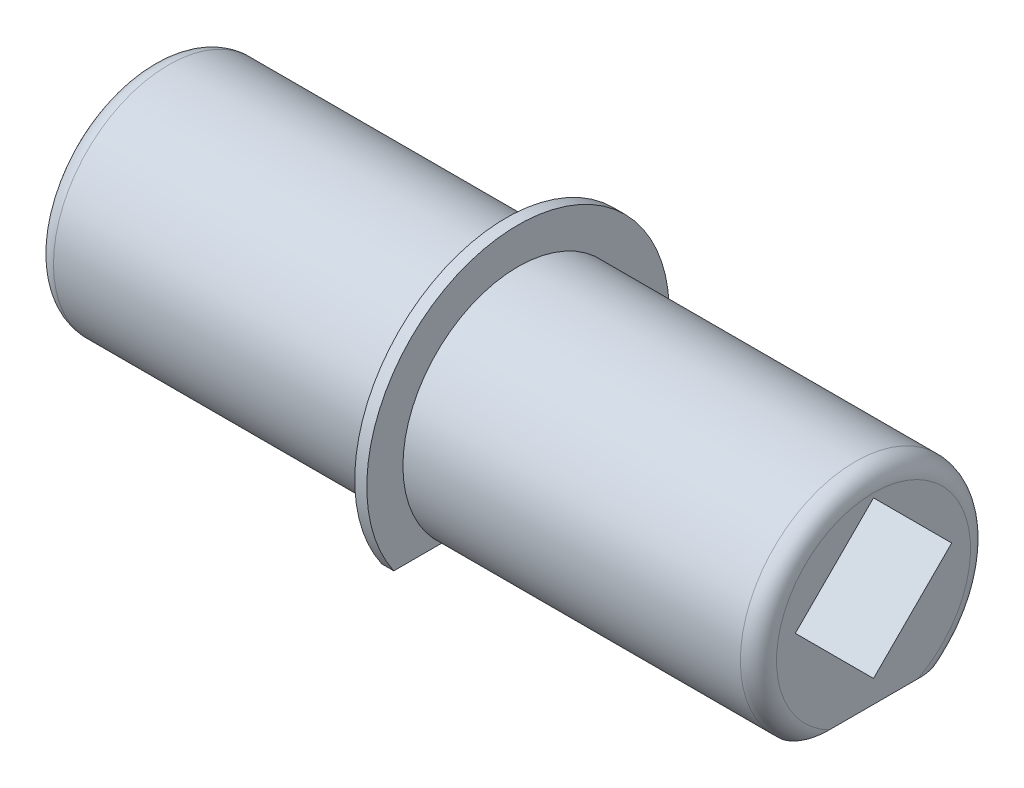
ISO-10303-21;
HEADER;
FILE_DESCRIPTION(('STEP AP214'),'2;1');
FILE_NAME('part.step','',(''),(''),'','','');
FILE_SCHEMA(('AUTOMOTIVE_DESIGN { 1 0 10303 214 1 1 1 1 }'));
ENDSEC;
DATA;
#1=APPLICATION_CONTEXT('core data for automotive mechanical design processes');
#2=APPLICATION_PROTOCOL_DEFINITION('international standard','automotive_design',2000,#1);
#3=PRODUCT_CONTEXT('',#1,'mechanical');
#4=PRODUCT('Part','Part','',(#3));
#5=PRODUCT_RELATED_PRODUCT_CATEGORY('part','',(#4));
#6=PRODUCT_DEFINITION_FORMATION('','',#4);
#7=PRODUCT_DEFINITION_CONTEXT('part definition',#1,'design');
#8=PRODUCT_DEFINITION('design','',#6,#7);
#9=PRODUCT_DEFINITION_SHAPE('','',#8);
#10=(LENGTH_UNIT() NAMED_UNIT(*) SI_UNIT(.MILLI.,.METRE.));
#11=(NAMED_UNIT(*) PLANE_ANGLE_UNIT() SI_UNIT($,.RADIAN.));
#12=(NAMED_UNIT(*) SI_UNIT($,.STERADIAN.) SOLID_ANGLE_UNIT());
#13=UNCERTAINTY_MEASURE_WITH_UNIT(LENGTH_MEASURE(1.E-05),#10,'distance_accuracy_value','');
#14=(GEOMETRIC_REPRESENTATION_CONTEXT(3) GLOBAL_UNCERTAINTY_ASSIGNED_CONTEXT((#13)) GLOBAL_UNIT_ASSIGNED_CONTEXT((#10,
#11,#12)) REPRESENTATION_CONTEXT('',''));
#15=CARTESIAN_POINT('',(0.,0.,0.));
#16=DIRECTION('',(0.,0.,1.));
#17=DIRECTION('',(1.,0.,0.));
#18=AXIS2_PLACEMENT_3D('',#15,#16,#17);
#19=CARTESIAN_POINT('',(30.,0.,0.));
#20=DIRECTION('',(-1.,0.,0.));
#21=DIRECTION('',(0.,0.,1.));
#22=AXIS2_PLACEMENT_3D('',#19,#20,#21);
#23=CYLINDRICAL_SURFACE('',#22,9.55);
#24=DIRECTION('',(-1.,0.,0.));
#25=VECTOR('',#24,1.);
#26=CARTESIAN_POINT('',(30.,-7.16095151873663,-6.31848663417939));
#27=LINE('',#26,#25);
#28=CARTESIAN_POINT('',(-0.5,-7.16095151873663,-6.31848663417939));
#29=VERTEX_POINT('',#28);
#30=CARTESIAN_POINT('',(-28.5,-7.16095151873663,-6.31848663417939));
#31=VERTEX_POINT('',#30);
#32=EDGE_CURVE('E212',#29,#31,#27,.T.);
#33=ORIENTED_EDGE('',*,*,#32,.T.);
#34=CARTESIAN_POINT('',(-28.5,0.,0.));
#35=DIRECTION('',(-1.,0.,0.));
#36=DIRECTION('',(0.,0.,1.));
#37=AXIS2_PLACEMENT_3D('',#34,#35,#36);
#38=CIRCLE('',#37,9.55);
#39=CARTESIAN_POINT('',(-28.5,-7.16095151873663,6.31848663417939));
#40=VERTEX_POINT('',#39);
#41=EDGE_CURVE('E151',#31,#40,#38,.F.);
#42=ORIENTED_EDGE('',*,*,#41,.T.);
#43=DIRECTION('',(-1.,0.,0.));
#44=VECTOR('',#43,1.);
#45=CARTESIAN_POINT('',(30.,-7.16095151873663,6.31848663417939));
#46=LINE('',#45,#44);
#47=CARTESIAN_POINT('',(-0.5,-7.16095151873663,6.31848663417939));
#48=VERTEX_POINT('',#47);
#49=EDGE_CURVE('E234',#48,#40,#46,.T.);
#50=ORIENTED_EDGE('',*,*,#49,.F.);
#51=CARTESIAN_POINT('',(-0.5,0.,0.));
#52=DIRECTION('',(1.,0.,0.));
#53=DIRECTION('',(0.,0.,-1.));
#54=AXIS2_PLACEMENT_3D('',#51,#52,#53);
#55=CIRCLE('',#54,9.55);
#56=EDGE_CURVE('E216',#29,#48,#55,.T.);
#57=ORIENTED_EDGE('',*,*,#56,.F.);
#58=EDGE_LOOP('',(#33,#42,#50,#57));
#59=FACE_BOUND('',#58,.T.);
#60=ADVANCED_FACE('F33',(#59),#23,.T.);
#61=CARTESIAN_POINT('',(28.5,-7.16095151873663,6.31848663417939));
#62=VERTEX_POINT('',#61);
#63=CARTESIAN_POINT('',(0.5,-7.16095151873663,6.31848663417939));
#64=VERTEX_POINT('',#63);
#65=EDGE_CURVE('E136',#62,#64,#46,.T.);
#66=ORIENTED_EDGE('',*,*,#65,.F.);
#67=CARTESIAN_POINT('',(28.5,0.,0.));
#68=DIRECTION('',(-1.,0.,0.));
#69=DIRECTION('',(0.,0.,1.));
#70=AXIS2_PLACEMENT_3D('',#67,#68,#69);
#71=CIRCLE('',#70,9.55);
#72=CARTESIAN_POINT('',(28.5,-7.16095151873663,-6.31848663417939));
#73=VERTEX_POINT('',#72);
#74=EDGE_CURVE('E11',#62,#73,#71,.T.);
#75=ORIENTED_EDGE('',*,*,#74,.T.);
#76=CARTESIAN_POINT('',(0.5,-7.16095151873663,-6.31848663417939));
#77=VERTEX_POINT('',#76);
#78=EDGE_CURVE('E218',#73,#77,#27,.T.);
#79=ORIENTED_EDGE('',*,*,#78,.T.);
#80=CARTESIAN_POINT('',(0.5,0.,0.));
#81=DIRECTION('',(1.,0.,0.));
#82=DIRECTION('',(0.,0.,-1.));
#83=AXIS2_PLACEMENT_3D('',#80,#81,#82);
#84=CIRCLE('',#83,9.55);
#85=EDGE_CURVE('E229',#77,#64,#84,.T.);
#86=ORIENTED_EDGE('',*,*,#85,.T.);
#87=EDGE_LOOP('',(#66,#75,#79,#86));
#88=FACE_BOUND('',#87,.T.);
#89=ADVANCED_FACE('F175',(#88),#23,.T.);
#90=CARTESIAN_POINT('',(30.,-7.16095151873663,6.31848663417939));
#91=DIRECTION('',(0.,1.,0.));
#92=DIRECTION('',(0.,0.,1.));
#93=AXIS2_PLACEMENT_3D('',#90,#91,#92);
#94=PLANE('',#93);
#95=ORIENTED_EDGE('',*,*,#49,.T.);
#96=CARTESIAN_POINT('',(-28.5,-7.16095151873663,6.31848663417939));
#97=CARTESIAN_POINT('',(-28.5318733770067,-7.16095151873663,6.31849260817078));
#98=CARTESIAN_POINT('',(-28.5637266274991,-7.16095151873663,6.3169497626022));
#99=CARTESIAN_POINT('',(-28.6271167394919,-7.16095151873663,6.31083760044619));
#100=CARTESIAN_POINT('',(-28.6586538309773,-7.16095151873663,6.30627067479063));
#101=CARTESIAN_POINT('',(-28.7518491151036,-7.16095151873663,6.28825338055403));
#102=CARTESIAN_POINT('',(-28.8127160318969,-7.16095151873663,6.27048336186496));
#103=CARTESIAN_POINT('',(-28.9302139455348,-7.16095151873663,6.22480298196199));
#104=CARTESIAN_POINT('',(-28.9868563335348,-7.16095151873663,6.19692117346765));
#105=CARTESIAN_POINT('',(-29.0952259256373,-7.16095151873663,6.13269695473244));
#106=CARTESIAN_POINT('',(-29.1469413315925,-7.16095151873663,6.0963349211174));
#107=CARTESIAN_POINT('',(-29.2652107981549,-7.16095151873663,6.00041831471656));
#108=CARTESIAN_POINT('',(-29.3290286671595,-7.16095151873663,5.93749819569366));
#109=CARTESIAN_POINT('',(-29.4457872391003,-7.16095151873663,5.80237922363466));
#110=CARTESIAN_POINT('',(-29.4987131686513,-7.16095151873663,5.73016798131827));
#111=CARTESIAN_POINT('',(-29.619604784911,-7.16095151873663,5.54016162493267));
#112=CARTESIAN_POINT('',(-29.6810244746625,-7.16095151873663,5.41822983048794));
#113=CARTESIAN_POINT('',(-29.7849082581943,-7.16095151873663,5.1660930938102));
#114=CARTESIAN_POINT('',(-29.8272576552333,-7.16095151873663,5.03584333436519));
#115=CARTESIAN_POINT('',(-29.888060411512,-7.16095151873663,4.80280976939323));
#116=CARTESIAN_POINT('',(-29.909800047651,-7.16095151873663,4.70084732373895));
#117=CARTESIAN_POINT('',(-29.945565041759,-7.16095151873663,4.49548678847933));
#118=CARTESIAN_POINT('',(-29.9595820365059,-7.16095151873663,4.39208726629842));
#119=CARTESIAN_POINT('',(-29.9808775624055,-7.16095151873663,4.18677964486397));
#120=CARTESIAN_POINT('',(-29.9882886817958,-7.16095151873663,4.08488457717203));
#121=CARTESIAN_POINT('',(-29.9978335121474,-7.16095151873663,3.88110888296237));
#122=CARTESIAN_POINT('',(-29.9999811155167,-7.16095151873663,3.77922892965797));
#123=CARTESIAN_POINT('',(-30.,-7.16095151873663,3.67740035164837));
#124=B_SPLINE_CURVE_WITH_KNOTS('',3,(#96,#97,#98,#99,#100,#101,#102,#103,#104,#105,#106,#107,
#108,#109,#110,#111,#112,#113,#114,#115,#116,#117,#118,#119,#120,#121,#122,#123),.UNSPECIFIED.,
.F.,.F.,(4,2,2,2,2,2,2,2,2,2,2,2,2,4),(0.,0.0955447194584399,0.191013988338751,
0.380108563569042,0.568673296468496,0.757678778179617,1.02503766420167,1.29275682905523,
1.70006070639644,2.10978259061023,2.4222238386537,2.73500278267042,3.04135248385913,
3.34689273745754),.UNSPECIFIED.);
#125=CARTESIAN_POINT('',(-30.,-7.16095151873663,3.67740035164837));
#126=VERTEX_POINT('',#125);
#127=EDGE_CURVE('E186',#40,#126,#124,.T.);
#128=ORIENTED_EDGE('',*,*,#127,.T.);
#129=DIRECTION('',(0.,0.,-1.));
#130=VECTOR('',#129,1.);
#131=CARTESIAN_POINT('',(-30.,-7.16095151873663,6.31848663417939));
#132=LINE('',#131,#130);
#133=CARTESIAN_POINT('',(-30.,-7.16095151873663,-3.67740035164837));
#134=VERTEX_POINT('',#133);
#135=EDGE_CURVE('E227',#126,#134,#132,.T.);
#136=ORIENTED_EDGE('',*,*,#135,.T.);
#137=CARTESIAN_POINT('',(-30.,-7.16095151873663,-3.67740035164837));
#138=CARTESIAN_POINT('',(-29.9999980535772,-7.16095151873663,-3.74016582102246));
#139=CARTESIAN_POINT('',(-29.9991780156413,-7.16095151873663,-3.80293053988021));
#140=CARTESIAN_POINT('',(-29.99568611644,-7.16095151873663,-3.92842992208869));
#141=CARTESIAN_POINT('',(-29.9930135906649,-7.16095151873663,-3.99116456656799));
#142=CARTESIAN_POINT('',(-29.9818479835522,-7.16095151873663,-4.17999715441019));
#143=CARTESIAN_POINT('',(-29.9702013414898,-7.16095151873663,-4.30593688969796));
#144=CARTESIAN_POINT('',(-29.9363033622074,-7.16095151873663,-4.55825400370718));
#145=CARTESIAN_POINT('',(-29.9139034816884,-7.16095151873663,-4.68461210915754));
#146=CARTESIAN_POINT('',(-29.8560444656343,-7.16095151873663,-4.93406017167305));
#147=CARTESIAN_POINT('',(-29.8206242210771,-7.16095151873663,-5.0571587028694));
#148=CARTESIAN_POINT('',(-29.7469890982615,-7.16095151873663,-5.26122298230803));
#149=CARTESIAN_POINT('',(-29.7128700265317,-7.16095151873663,-5.34365724337444));
#150=CARTESIAN_POINT('',(-29.6358297999747,-7.16095151873663,-5.50420725867701));
#151=CARTESIAN_POINT('',(-29.5929243826493,-7.16095151873663,-5.58233042138917));
#152=CARTESIAN_POINT('',(-29.4967237899667,-7.16095151873663,-5.73304949733991));
#153=CARTESIAN_POINT('',(-29.4433338597528,-7.16095151873663,-5.80558590647172));
#154=CARTESIAN_POINT('',(-29.3255067635305,-7.16095151873663,-5.94118880864024));
#155=CARTESIAN_POINT('',(-29.2610825675723,-7.16095151873663,-6.00426625862396));
#156=CARTESIAN_POINT('',(-29.1405495550537,-7.16095151873663,-6.10112658256514));
#157=CARTESIAN_POINT('',(-29.0870822589444,-7.16095151873663,-6.13818383822377));
#158=CARTESIAN_POINT('',(-28.9749654442909,-7.16095151873663,-6.20318054299254));
#159=CARTESIAN_POINT('',(-28.916329511018,-7.16095151873663,-6.23114303907984));
#160=CARTESIAN_POINT('',(-28.7990712693324,-7.16095151873663,-6.27463852913582));
#161=CARTESIAN_POINT('',(-28.7407202947624,-7.16095151873663,-6.2908886509242));
#162=CARTESIAN_POINT('',(-28.6515372368214,-7.16095151873663,-6.30734524261541));
#163=CARTESIAN_POINT('',(-28.6213983420132,-7.16095151873663,-6.31151160308323));
#164=CARTESIAN_POINT('',(-28.56084539691,-7.16095151873663,-6.31708586302416));
#165=CARTESIAN_POINT('',(-28.5304311655794,-7.16095151873663,-6.31849179155522));
#166=CARTESIAN_POINT('',(-28.5,-7.16095151873663,-6.31848663417939));
#167=B_SPLINE_CURVE_WITH_KNOTS('',3,(#137,#138,#139,#140,#141,#142,#143,#144,#145,#146,#147,
#148,#149,#150,#151,#152,#153,#154,#155,#156,#157,#158,#159,#160,#161,#162,#163,#164,#165,#166),
.UNSPECIFIED.,.F.,.F.,(4,2,2,2,2,2,2,2,2,2,2,2,2,2,4),(0.,0.188286128874768,0.376639833229845,
0.755703838339681,1.14016180798264,1.52348063599099,1.79069913200565,2.05744312629371,
2.32671908155475,2.59568066607999,2.79012342355242,2.98406953457358,3.16479986322438,
3.25596368653264,3.34719257696514),.UNSPECIFIED.);
#168=EDGE_CURVE('E181',#134,#31,#167,.T.);
#169=ORIENTED_EDGE('',*,*,#168,.T.);
#170=ORIENTED_EDGE('',*,*,#32,.F.);
#171=DIRECTION('',(0.,0.,-1.));
#172=VECTOR('',#171,1.);
#173=CARTESIAN_POINT('',(-0.5,-7.16095151873663,10.3064675493742));
#174=LINE('',#173,#172);
#175=CARTESIAN_POINT('',(-0.5,-7.16095151873663,-10.3064675493742));
#176=VERTEX_POINT('',#175);
#177=EDGE_CURVE('E266',#29,#176,#174,.T.);
#178=ORIENTED_EDGE('',*,*,#177,.T.);
#179=DIRECTION('',(-1.,0.,0.));
#180=VECTOR('',#179,1.);
#181=CARTESIAN_POINT('',(0.5,-7.16095151873663,-10.3064675493742));
#182=LINE('',#181,#180);
#183=CARTESIAN_POINT('',(0.5,-7.16095151873663,-10.3064675493742));
#184=VERTEX_POINT('',#183);
#185=EDGE_CURVE('E263',#184,#176,#182,.T.);
#186=ORIENTED_EDGE('',*,*,#185,.F.);
#187=DIRECTION('',(0.,0.,-1.));
#188=VECTOR('',#187,1.);
#189=CARTESIAN_POINT('',(0.5,-7.16095151873663,10.3064675493742));
#190=LINE('',#189,#188);
#191=EDGE_CURVE('E258',#77,#184,#190,.T.);
#192=ORIENTED_EDGE('',*,*,#191,.F.);
#193=ORIENTED_EDGE('',*,*,#78,.F.);
#194=CARTESIAN_POINT('',(28.5,-7.16095151873663,-6.31848663417939));
#195=CARTESIAN_POINT('',(28.5318733770067,-7.16095151873663,-6.31849260817078));
#196=CARTESIAN_POINT('',(28.5637266274991,-7.16095151873663,-6.3169497626022));
#197=CARTESIAN_POINT('',(28.6271167394919,-7.16095151873663,-6.31083760044619));
#198=CARTESIAN_POINT('',(28.6586538309773,-7.16095151873663,-6.30627067479063));
#199=CARTESIAN_POINT('',(28.7518491151036,-7.16095151873663,-6.28825338055403));
#200=CARTESIAN_POINT('',(28.8127160318969,-7.16095151873663,-6.27048336186496));
#201=CARTESIAN_POINT('',(28.9302139455348,-7.16095151873663,-6.22480298196199));
#202=CARTESIAN_POINT('',(28.9868563335348,-7.16095151873663,-6.19692117346765));
#203=CARTESIAN_POINT('',(29.0952259256373,-7.16095151873663,-6.13269695473244));
#204=CARTESIAN_POINT('',(29.1469413315925,-7.16095151873663,-6.0963349211174));
#205=CARTESIAN_POINT('',(29.2652107981549,-7.16095151873663,-6.00041831471656));
#206=CARTESIAN_POINT('',(29.3290286671595,-7.16095151873663,-5.93749819569366));
#207=CARTESIAN_POINT('',(29.4457872391003,-7.16095151873663,-5.80237922363466));
#208=CARTESIAN_POINT('',(29.4987131686513,-7.16095151873663,-5.73016798131827));
#209=CARTESIAN_POINT('',(29.619604784911,-7.16095151873663,-5.54016162493267));
#210=CARTESIAN_POINT('',(29.6810244746625,-7.16095151873663,-5.41822983048794));
#211=CARTESIAN_POINT('',(29.7849082581943,-7.16095151873663,-5.1660930938102));
#212=CARTESIAN_POINT('',(29.8272576552333,-7.16095151873663,-5.03584333436519));
#213=CARTESIAN_POINT('',(29.888060411512,-7.16095151873663,-4.80280976939323));
#214=CARTESIAN_POINT('',(29.909800047651,-7.16095151873663,-4.70084732373895));
#215=CARTESIAN_POINT('',(29.945565041759,-7.16095151873663,-4.49548678847933));
#216=CARTESIAN_POINT('',(29.9595820365059,-7.16095151873663,-4.39208726629842));
#217=CARTESIAN_POINT('',(29.9808775624055,-7.16095151873663,-4.18677964486397));
#218=CARTESIAN_POINT('',(29.9882886817958,-7.16095151873663,-4.08488457717203));
#219=CARTESIAN_POINT('',(29.9978335121474,-7.16095151873663,-3.88110888296237));
#220=CARTESIAN_POINT('',(29.9999811155167,-7.16095151873663,-3.77922892965797));
#221=CARTESIAN_POINT('',(30.,-7.16095151873663,-3.67740035164837));
#222=B_SPLINE_CURVE_WITH_KNOTS('',3,(#194,#195,#196,#197,#198,#199,#200,#201,#202,#203,#204,
#205,#206,#207,#208,#209,#210,#211,#212,#213,#214,#215,#216,#217,#218,#219,#220,#221),
.UNSPECIFIED.,.F.,.F.,(4,2,2,2,2,2,2,2,2,2,2,2,2,4),(0.,0.0955447194584399,0.191013988338751,
0.380108563569042,0.568673296468496,0.757678778179617,1.02503766420167,1.29275682905523,
1.70006070639644,2.10978259061023,2.4222238386537,2.73500278267042,3.04135248385913,
3.34689273745754),.UNSPECIFIED.);
#223=CARTESIAN_POINT('',(30.,-7.16095151873663,-3.67740035164837));
#224=VERTEX_POINT('',#223);
#225=EDGE_CURVE('E49',#73,#224,#222,.T.);
#226=ORIENTED_EDGE('',*,*,#225,.T.);
#227=DIRECTION('',(0.,0.,-1.));
#228=VECTOR('',#227,1.);
#229=CARTESIAN_POINT('',(30.,-7.16095151873663,6.31848663417939));
#230=LINE('',#229,#228);
#231=CARTESIAN_POINT('',(30.,-7.16095151873663,3.67740035164837));
#232=VERTEX_POINT('',#231);
#233=EDGE_CURVE('E219',#232,#224,#230,.T.);
#234=ORIENTED_EDGE('',*,*,#233,.F.);
#235=CARTESIAN_POINT('',(30.,-7.16095151873663,3.67740035164837));
#236=CARTESIAN_POINT('',(29.9999980535772,-7.16095151873663,3.74016582102246));
#237=CARTESIAN_POINT('',(29.9991780156413,-7.16095151873663,3.80293053988021));
#238=CARTESIAN_POINT('',(29.99568611644,-7.16095151873663,3.92842992208869));
#239=CARTESIAN_POINT('',(29.9930135906649,-7.16095151873663,3.99116456656799));
#240=CARTESIAN_POINT('',(29.9818479835522,-7.16095151873663,4.17999715441019));
#241=CARTESIAN_POINT('',(29.9702013414898,-7.16095151873663,4.30593688969796));
#242=CARTESIAN_POINT('',(29.9363033622074,-7.16095151873663,4.55825400370718));
#243=CARTESIAN_POINT('',(29.9139034816884,-7.16095151873663,4.68461210915754));
#244=CARTESIAN_POINT('',(29.8560444656343,-7.16095151873663,4.93406017167305));
#245=CARTESIAN_POINT('',(29.8206242210771,-7.16095151873663,5.0571587028694));
#246=CARTESIAN_POINT('',(29.7469890982615,-7.16095151873663,5.26122298230803));
#247=CARTESIAN_POINT('',(29.7128700265317,-7.16095151873663,5.34365724337444));
#248=CARTESIAN_POINT('',(29.6358297999747,-7.16095151873663,5.50420725867701));
#249=CARTESIAN_POINT('',(29.5929243826493,-7.16095151873663,5.58233042138917));
#250=CARTESIAN_POINT('',(29.4967237899667,-7.16095151873663,5.73304949733991));
#251=CARTESIAN_POINT('',(29.4433338597528,-7.16095151873663,5.80558590647172));
#252=CARTESIAN_POINT('',(29.3255067635305,-7.16095151873663,5.94118880864024));
#253=CARTESIAN_POINT('',(29.2610825675723,-7.16095151873663,6.00426625862396));
#254=CARTESIAN_POINT('',(29.1405495550537,-7.16095151873663,6.10112658256514));
#255=CARTESIAN_POINT('',(29.0870822589444,-7.16095151873663,6.13818383822377));
#256=CARTESIAN_POINT('',(28.9749654442909,-7.16095151873663,6.20318054299254));
#257=CARTESIAN_POINT('',(28.916329511018,-7.16095151873663,6.23114303907984));
#258=CARTESIAN_POINT('',(28.7990712693324,-7.16095151873663,6.27463852913582));
#259=CARTESIAN_POINT('',(28.7407202947624,-7.16095151873663,6.2908886509242));
#260=CARTESIAN_POINT('',(28.6515372368214,-7.16095151873663,6.30734524261541));
#261=CARTESIAN_POINT('',(28.6213983420132,-7.16095151873663,6.31151160308323));
#262=CARTESIAN_POINT('',(28.56084539691,-7.16095151873663,6.31708586302416));
#263=CARTESIAN_POINT('',(28.5304311655794,-7.16095151873663,6.31849179155522));
#264=CARTESIAN_POINT('',(28.5,-7.16095151873663,6.31848663417939));
#265=B_SPLINE_CURVE_WITH_KNOTS('',3,(#235,#236,#237,#238,#239,#240,#241,#242,#243,#244,#245,
#246,#247,#248,#249,#250,#251,#252,#253,#254,#255,#256,#257,#258,#259,#260,#261,#262,#263,#264),
.UNSPECIFIED.,.F.,.F.,(4,2,2,2,2,2,2,2,2,2,2,2,2,2,4),(0.,0.188286128874768,0.376639833229845,
0.755703838339681,1.14016180798264,1.52348063599099,1.79069913200565,2.05744312629371,
2.32671908155475,2.59568066607999,2.79012342355242,2.98406953457358,3.16479986322438,
3.25596368653264,3.34719257696514),.UNSPECIFIED.);
#266=EDGE_CURVE('E57',#232,#62,#265,.T.);
#267=ORIENTED_EDGE('',*,*,#266,.T.);
#268=ORIENTED_EDGE('',*,*,#65,.T.);
#269=CARTESIAN_POINT('',(0.5,-7.16095151873663,10.3064675493742));
#270=VERTEX_POINT('',#269);
#271=EDGE_CURVE('E260',#270,#64,#190,.T.);
#272=ORIENTED_EDGE('',*,*,#271,.F.);
#273=DIRECTION('',(-1.,0.,0.));
#274=VECTOR('',#273,1.);
#275=CARTESIAN_POINT('',(0.5,-7.16095151873663,10.3064675493742));
#276=LINE('',#275,#274);
#277=CARTESIAN_POINT('',(-0.5,-7.16095151873663,10.3064675493742));
#278=VERTEX_POINT('',#277);
#279=EDGE_CURVE('E271',#270,#278,#276,.T.);
#280=ORIENTED_EDGE('',*,*,#279,.T.);
#281=EDGE_CURVE('E259',#278,#48,#174,.T.);
#282=ORIENTED_EDGE('',*,*,#281,.T.);
#283=EDGE_LOOP('',(#95,#128,#136,#169,#170,#178,#186,#192,#193,#226,#234,#267,#268,#272,#280,#282));
#284=FACE_BOUND('',#283,.T.);
#285=ADVANCED_FACE('F169',(#284),#94,.F.);
#286=CARTESIAN_POINT('',(30.,0.,0.));
#287=DIRECTION('',(-1.,0.,0.));
#288=DIRECTION('',(0.,0.,1.));
#289=AXIS2_PLACEMENT_3D('',#286,#287,#288);
#290=PLANE('',#289);
#291=DIRECTION('',(0.,0.707106781186548,-0.707106781186547));
#292=VECTOR('',#291,1.);
#293=CARTESIAN_POINT('',(30.,3.84148349391259,3.84148349391259));
#294=LINE('',#293,#292);
#295=CARTESIAN_POINT('',(30.,1.19452424063168,6.4884427471935));
#296=VERTEX_POINT('',#295);
#297=CARTESIAN_POINT('',(30.,7.68296698782519,0.));
#298=VERTEX_POINT('',#297);
#299=EDGE_CURVE('E245',#296,#298,#294,.T.);
#300=ORIENTED_EDGE('',*,*,#299,.T.);
#301=DIRECTION('',(0.,-0.707106781186548,-0.707106781186548));
#302=VECTOR('',#301,1.);
#303=CARTESIAN_POINT('',(30.,3.84148349391259,-3.84148349391259));
#304=LINE('',#303,#302);
#305=CARTESIAN_POINT('',(30.,1.19452424063168,-6.4884427471935));
#306=VERTEX_POINT('',#305);
#307=EDGE_CURVE('E144',#298,#306,#304,.T.);
#308=ORIENTED_EDGE('',*,*,#307,.T.);
#309=DIRECTION('',(0.,-0.707106781186548,0.707106781186548));
#310=VECTOR('',#309,1.);
#311=CARTESIAN_POINT('',(30.,-2.64695925328091,-2.64695925328091));
#312=LINE('',#311,#310);
#313=CARTESIAN_POINT('',(30.,-5.29391850656182,0.));
#314=VERTEX_POINT('',#313);
#315=EDGE_CURVE('E251',#306,#314,#312,.T.);
#316=ORIENTED_EDGE('',*,*,#315,.T.);
#317=DIRECTION('',(0.,0.707106781186548,0.707106781186547));
#318=VECTOR('',#317,1.);
#319=CARTESIAN_POINT('',(30.,-2.64695925328091,2.64695925328091));
#320=LINE('',#319,#318);
#321=EDGE_CURVE('E240',#314,#296,#320,.T.);
#322=ORIENTED_EDGE('',*,*,#321,.T.);
#323=EDGE_LOOP('',(#300,#308,#316,#322));
#324=FACE_BOUND('',#323,.T.);
#325=ORIENTED_EDGE('',*,*,#233,.T.);
#326=CARTESIAN_POINT('',(30.,0.,0.));
#327=DIRECTION('',(-1.,0.,0.));
#328=DIRECTION('',(0.,0.,1.));
#329=AXIS2_PLACEMENT_3D('',#326,#327,#328);
#330=CIRCLE('',#329,8.05);
#331=EDGE_CURVE('E42',#224,#232,#330,.F.);
#332=ORIENTED_EDGE('',*,*,#331,.T.);
#333=EDGE_LOOP('',(#325,#332));
#334=FACE_BOUND('',#333,.T.);
#335=ADVANCED_FACE('F174',(#324,#334),#290,.F.);
#336=CARTESIAN_POINT('',(-30.,0.,0.));
#337=DIRECTION('',(-1.,0.,0.));
#338=DIRECTION('',(0.,0.,1.));
#339=AXIS2_PLACEMENT_3D('',#336,#337,#338);
#340=PLANE('',#339);
#341=DIRECTION('',(0.,-0.707106781186548,-0.707106781186548));
#342=VECTOR('',#341,1.);
#343=CARTESIAN_POINT('',(-30.,3.84148349391259,-3.84148349391259));
#344=LINE('',#343,#342);
#345=CARTESIAN_POINT('',(-30.,7.68296698782519,0.));
#346=VERTEX_POINT('',#345);
#347=CARTESIAN_POINT('',(-30.,1.19452424063168,-6.4884427471935));
#348=VERTEX_POINT('',#347);
#349=EDGE_CURVE('E141',#346,#348,#344,.T.);
#350=ORIENTED_EDGE('',*,*,#349,.F.);
#351=DIRECTION('',(0.,0.707106781186548,-0.707106781186547));
#352=VECTOR('',#351,1.);
#353=CARTESIAN_POINT('',(-30.,3.84148349391259,3.84148349391259));
#354=LINE('',#353,#352);
#355=CARTESIAN_POINT('',(-30.,1.19452424063169,6.4884427471935));
#356=VERTEX_POINT('',#355);
#357=EDGE_CURVE('E124',#356,#346,#354,.T.);
#358=ORIENTED_EDGE('',*,*,#357,.F.);
#359=DIRECTION('',(0.,0.707106781186548,0.707106781186547));
#360=VECTOR('',#359,1.);
#361=CARTESIAN_POINT('',(-30.,-2.64695925328091,2.64695925328091));
#362=LINE('',#361,#360);
#363=CARTESIAN_POINT('',(-30.,-5.29391850656182,0.));
#364=VERTEX_POINT('',#363);
#365=EDGE_CURVE('E135',#364,#356,#362,.T.);
#366=ORIENTED_EDGE('',*,*,#365,.F.);
#367=DIRECTION('',(0.,-0.707106781186548,0.707106781186548));
#368=VECTOR('',#367,1.);
#369=CARTESIAN_POINT('',(-30.,-2.64695925328091,-2.64695925328091));
#370=LINE('',#369,#368);
#371=EDGE_CURVE('E150',#348,#364,#370,.T.);
#372=ORIENTED_EDGE('',*,*,#371,.F.);
#373=EDGE_LOOP('',(#350,#358,#366,#372));
#374=FACE_BOUND('',#373,.T.);
#375=ORIENTED_EDGE('',*,*,#135,.F.);
#376=CARTESIAN_POINT('',(-30.,0.,0.));
#377=DIRECTION('',(-1.,0.,0.));
#378=DIRECTION('',(0.,0.,1.));
#379=AXIS2_PLACEMENT_3D('',#376,#377,#378);
#380=CIRCLE('',#379,8.05);
#381=EDGE_CURVE('E222',#126,#134,#380,.T.);
#382=ORIENTED_EDGE('',*,*,#381,.T.);
#383=EDGE_LOOP('',(#375,#382));
#384=FACE_BOUND('',#383,.T.);
#385=ADVANCED_FACE('F148',(#374,#384),#340,.T.);
#386=CARTESIAN_POINT('',(0.5,0.,0.));
#387=DIRECTION('',(1.,0.,0.));
#388=DIRECTION('',(0.,0.,-1.));
#389=AXIS2_PLACEMENT_3D('',#386,#387,#388);
#390=PLANE('',#389);
#391=ORIENTED_EDGE('',*,*,#85,.F.);
#392=ORIENTED_EDGE('',*,*,#191,.T.);
#393=CARTESIAN_POINT('',(0.5,0.,0.));
#394=DIRECTION('',(1.,0.,0.));
#395=DIRECTION('',(0.,0.,-1.));
#396=AXIS2_PLACEMENT_3D('',#393,#394,#395);
#397=CIRCLE('',#396,12.55);
#398=EDGE_CURVE('E255',#184,#270,#397,.T.);
#399=ORIENTED_EDGE('',*,*,#398,.T.);
#400=ORIENTED_EDGE('',*,*,#271,.T.);
#401=EDGE_LOOP('',(#391,#392,#399,#400));
#402=FACE_BOUND('',#401,.T.);
#403=ADVANCED_FACE('F278',(#402),#390,.T.);
#404=CARTESIAN_POINT('',(-0.5,0.,0.));
#405=DIRECTION('',(1.,0.,0.));
#406=DIRECTION('',(0.,0.,-1.));
#407=AXIS2_PLACEMENT_3D('',#404,#405,#406);
#408=PLANE('',#407);
#409=ORIENTED_EDGE('',*,*,#177,.F.);
#410=ORIENTED_EDGE('',*,*,#56,.T.);
#411=ORIENTED_EDGE('',*,*,#281,.F.);
#412=CARTESIAN_POINT('',(-0.5,0.,0.));
#413=DIRECTION('',(1.,0.,0.));
#414=DIRECTION('',(0.,0.,-1.));
#415=AXIS2_PLACEMENT_3D('',#412,#413,#414);
#416=CIRCLE('',#415,12.55);
#417=EDGE_CURVE('E254',#176,#278,#416,.T.);
#418=ORIENTED_EDGE('',*,*,#417,.F.);
#419=EDGE_LOOP('',(#409,#410,#411,#418));
#420=FACE_BOUND('',#419,.T.);
#421=ADVANCED_FACE('F285',(#420),#408,.F.);
#422=CARTESIAN_POINT('',(0.5,0.,0.));
#423=DIRECTION('',(-1.,0.,0.));
#424=DIRECTION('',(0.,0.,1.));
#425=AXIS2_PLACEMENT_3D('',#422,#423,#424);
#426=CYLINDRICAL_SURFACE('',#425,12.55);
#427=ORIENTED_EDGE('',*,*,#417,.T.);
#428=ORIENTED_EDGE('',*,*,#279,.F.);
#429=ORIENTED_EDGE('',*,*,#398,.F.);
#430=ORIENTED_EDGE('',*,*,#185,.T.);
#431=EDGE_LOOP('',(#427,#428,#429,#430));
#432=FACE_BOUND('',#431,.T.);
#433=ADVANCED_FACE('F283',(#432),#426,.T.);
#434=CARTESIAN_POINT('',(-50.,7.68296698782519,0.));
#435=DIRECTION('',(0.,0.707106781186547,-0.707106781186547));
#436=DIRECTION('',(0.,0.707106781186548,0.707106781186548));
#437=AXIS2_PLACEMENT_3D('',#434,#435,#436);
#438=PLANE('',#437);
#439=DIRECTION('',(1.,0.,0.));
#440=VECTOR('',#439,1.);
#441=CARTESIAN_POINT('',(-50.,7.68296698782519,0.));
#442=LINE('',#441,#440);
#443=EDGE_CURVE('E127',#346,#298,#442,.T.);
#444=ORIENTED_EDGE('',*,*,#443,.F.);
#445=ORIENTED_EDGE('',*,*,#349,.T.);
#446=DIRECTION('',(1.,0.,0.));
#447=VECTOR('',#446,1.);
#448=CARTESIAN_POINT('',(-50.,1.19452424063168,-6.4884427471935));
#449=LINE('',#448,#447);
#450=EDGE_CURVE('E243',#348,#306,#449,.T.);
#451=ORIENTED_EDGE('',*,*,#450,.T.);
#452=ORIENTED_EDGE('',*,*,#307,.F.);
#453=EDGE_LOOP('',(#444,#445,#451,#452));
#454=FACE_BOUND('',#453,.T.);
#455=ADVANCED_FACE('F139',(#454),#438,.F.);
#456=CARTESIAN_POINT('',(-50.,-5.29391850656182,0.));
#457=DIRECTION('',(0.,-0.707106781186547,-0.707106781186547));
#458=DIRECTION('',(0.,0.707106781186548,-0.707106781186548));
#459=AXIS2_PLACEMENT_3D('',#456,#457,#458);
#460=PLANE('',#459);
#461=ORIENTED_EDGE('',*,*,#450,.F.);
#462=ORIENTED_EDGE('',*,*,#371,.T.);
#463=DIRECTION('',(1.,0.,0.));
#464=VECTOR('',#463,1.);
#465=CARTESIAN_POINT('',(-50.,-5.29391850656182,0.));
#466=LINE('',#465,#464);
#467=EDGE_CURVE('E239',#364,#314,#466,.T.);
#468=ORIENTED_EDGE('',*,*,#467,.T.);
#469=ORIENTED_EDGE('',*,*,#315,.F.);
#470=EDGE_LOOP('',(#461,#462,#468,#469));
#471=FACE_BOUND('',#470,.T.);
#472=ADVANCED_FACE('F300',(#471),#460,.F.);
#473=CARTESIAN_POINT('',(-50.,1.19452424063168,6.4884427471935));
#474=DIRECTION('',(0.,-0.707106781186547,0.707106781186548));
#475=DIRECTION('',(0.,-0.707106781186548,-0.707106781186547));
#476=AXIS2_PLACEMENT_3D('',#473,#474,#475);
#477=PLANE('',#476);
#478=ORIENTED_EDGE('',*,*,#467,.F.);
#479=ORIENTED_EDGE('',*,*,#365,.T.);
#480=DIRECTION('',(1.,0.,0.));
#481=VECTOR('',#480,1.);
#482=CARTESIAN_POINT('',(-50.,1.19452424063168,6.4884427471935));
#483=LINE('',#482,#481);
#484=EDGE_CURVE('E130',#356,#296,#483,.T.);
#485=ORIENTED_EDGE('',*,*,#484,.T.);
#486=ORIENTED_EDGE('',*,*,#321,.F.);
#487=EDGE_LOOP('',(#478,#479,#485,#486));
#488=FACE_BOUND('',#487,.T.);
#489=ADVANCED_FACE('F201',(#488),#477,.F.);
#490=CARTESIAN_POINT('',(-50.,1.19452424063168,6.4884427471935));
#491=DIRECTION('',(0.,0.707106781186547,0.707106781186548));
#492=DIRECTION('',(0.,-0.707106781186548,0.707106781186547));
#493=AXIS2_PLACEMENT_3D('',#490,#491,#492);
#494=PLANE('',#493);
#495=ORIENTED_EDGE('',*,*,#484,.F.);
#496=ORIENTED_EDGE('',*,*,#357,.T.);
#497=ORIENTED_EDGE('',*,*,#443,.T.);
#498=ORIENTED_EDGE('',*,*,#299,.F.);
#499=EDGE_LOOP('',(#495,#496,#497,#498));
#500=FACE_BOUND('',#499,.T.);
#501=ADVANCED_FACE('F126',(#500),#494,.F.);
#502=CARTESIAN_POINT('',(-28.5,0.,0.));
#503=DIRECTION('',(-1.,0.,0.));
#504=DIRECTION('',(0.,0.,1.));
#505=AXIS2_PLACEMENT_3D('',#502,#503,#504);
#506=TOROIDAL_SURFACE('',#505,8.05,1.5);
#507=ORIENTED_EDGE('',*,*,#168,.F.);
#508=ORIENTED_EDGE('',*,*,#381,.F.);
#509=ORIENTED_EDGE('',*,*,#127,.F.);
#510=ORIENTED_EDGE('',*,*,#41,.F.);
#511=EDGE_LOOP('',(#507,#508,#509,#510));
#512=FACE_BOUND('',#511,.T.);
#513=ADVANCED_FACE('F192',(#512),#506,.T.);
#514=CARTESIAN_POINT('',(28.5,0.,0.));
#515=DIRECTION('',(-1.,0.,0.));
#516=DIRECTION('',(0.,0.,1.));
#517=AXIS2_PLACEMENT_3D('',#514,#515,#516);
#518=TOROIDAL_SURFACE('',#517,8.05,1.5);
#519=ORIENTED_EDGE('',*,*,#225,.F.);
#520=ORIENTED_EDGE('',*,*,#74,.F.);
#521=ORIENTED_EDGE('',*,*,#266,.F.);
#522=ORIENTED_EDGE('',*,*,#331,.F.);
#523=EDGE_LOOP('',(#519,#520,#521,#522));
#524=FACE_BOUND('',#523,.T.);
#525=ADVANCED_FACE('F35',(#524),#518,.T.);
#526=CLOSED_SHELL('',(#60,#89,#285,#335,#385,#403,#421,#433,#455,#472,#489,#501,#513,#525));
#527=MANIFOLD_SOLID_BREP('B2',#526);
#528=ADVANCED_BREP_SHAPE_REPRESENTATION('',(#18,#527),#14);
#529=SHAPE_DEFINITION_REPRESENTATION(#9,#528);
ENDSEC;
END-ISO-10303-21;
